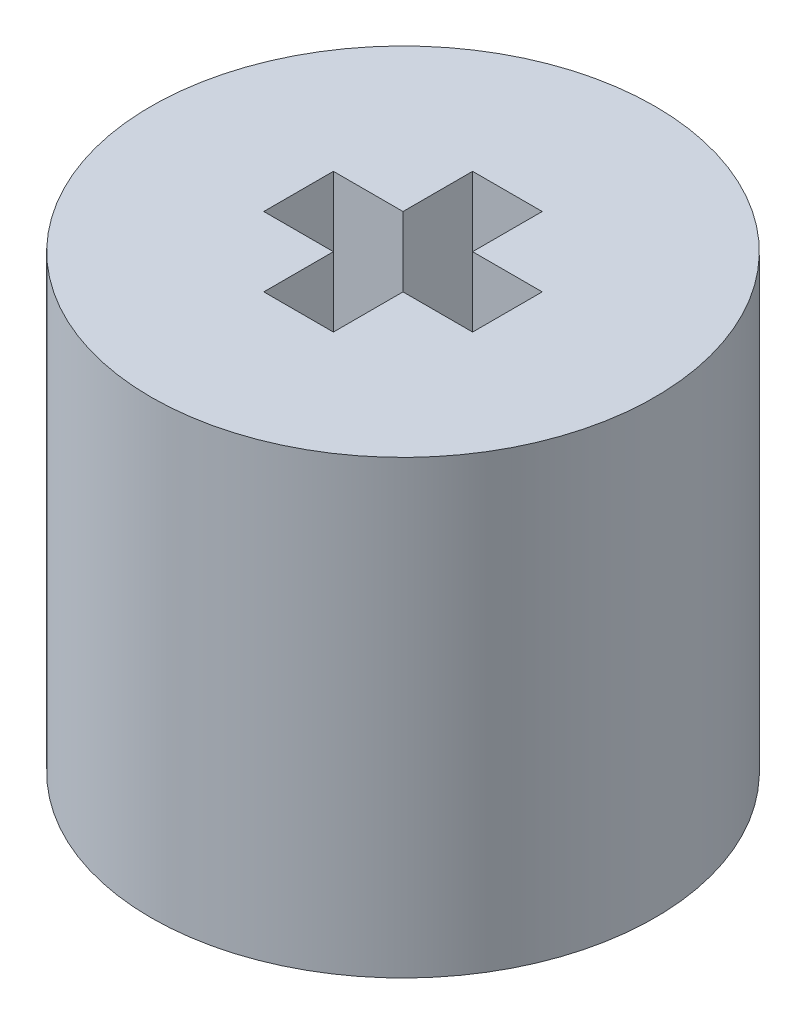
ISO-10303-21;
HEADER;
FILE_DESCRIPTION(('STEP AP214'),'2;1');
FILE_NAME('part.step','',(''),(''),'','','');
FILE_SCHEMA(('AUTOMOTIVE_DESIGN { 1 0 10303 214 1 1 1 1 }'));
ENDSEC;
DATA;
#1=APPLICATION_CONTEXT('core data for automotive mechanical design processes');
#2=APPLICATION_PROTOCOL_DEFINITION('international standard','automotive_design',2000,#1);
#3=PRODUCT_CONTEXT('',#1,'mechanical');
#4=PRODUCT('Part','Part','',(#3));
#5=PRODUCT_RELATED_PRODUCT_CATEGORY('part','',(#4));
#6=PRODUCT_DEFINITION_FORMATION('','',#4);
#7=PRODUCT_DEFINITION_CONTEXT('part definition',#1,'design');
#8=PRODUCT_DEFINITION('design','',#6,#7);
#9=PRODUCT_DEFINITION_SHAPE('','',#8);
#10=(LENGTH_UNIT() NAMED_UNIT(*) SI_UNIT(.MILLI.,.METRE.));
#11=(NAMED_UNIT(*) PLANE_ANGLE_UNIT() SI_UNIT($,.RADIAN.));
#12=(NAMED_UNIT(*) SI_UNIT($,.STERADIAN.) SOLID_ANGLE_UNIT());
#13=UNCERTAINTY_MEASURE_WITH_UNIT(LENGTH_MEASURE(1.E-05),#10,'distance_accuracy_value','');
#14=(GEOMETRIC_REPRESENTATION_CONTEXT(3) GLOBAL_UNCERTAINTY_ASSIGNED_CONTEXT((#13)) GLOBAL_UNIT_ASSIGNED_CONTEXT((#10,
#11,#12)) REPRESENTATION_CONTEXT('',''));
#15=CARTESIAN_POINT('',(0.,0.,0.));
#16=DIRECTION('',(0.,0.,1.));
#17=DIRECTION('',(1.,0.,0.));
#18=AXIS2_PLACEMENT_3D('',#15,#16,#17);
#19=CARTESIAN_POINT('',(0.,0.,0.));
#20=DIRECTION('',(0.,1.,0.));
#21=DIRECTION('',(0.,0.,1.));
#22=AXIS2_PLACEMENT_3D('',#19,#20,#21);
#23=PLANE('',#22);
#24=CARTESIAN_POINT('',(0.,0.,0.));
#25=DIRECTION('',(0.,1.,0.));
#26=DIRECTION('',(0.,0.,1.));
#27=AXIS2_PLACEMENT_3D('',#24,#25,#26);
#28=CIRCLE('',#27,7.239);
#29=CARTESIAN_POINT('',(0.,0.,7.239));
#30=VERTEX_POINT('',#29);
#31=EDGE_CURVE('E11',#30,#30,#28,.T.);
#32=ORIENTED_EDGE('',*,*,#31,.F.);
#33=EDGE_LOOP('',(#32));
#34=FACE_BOUND('',#33,.T.);
#35=DIRECTION('',(0.,0.,-1.));
#36=VECTOR('',#35,1.);
#37=CARTESIAN_POINT('',(1.5875,0.,-1.5875));
#38=LINE('',#37,#36);
#39=CARTESIAN_POINT('',(1.5875,0.,1.5875));
#40=VERTEX_POINT('',#39);
#41=CARTESIAN_POINT('',(1.5875,0.,-1.5875));
#42=VERTEX_POINT('',#41);
#43=EDGE_CURVE('E242',#40,#42,#38,.T.);
#44=ORIENTED_EDGE('',*,*,#43,.T.);
#45=DIRECTION('',(-1.,0.,0.));
#46=VECTOR('',#45,1.);
#47=CARTESIAN_POINT('',(-1.5875,0.,-1.5875));
#48=LINE('',#47,#46);
#49=CARTESIAN_POINT('',(-1.5875,0.,-1.5875));
#50=VERTEX_POINT('',#49);
#51=EDGE_CURVE('E259',#42,#50,#48,.T.);
#52=ORIENTED_EDGE('',*,*,#51,.T.);
#53=DIRECTION('',(0.,0.,1.));
#54=VECTOR('',#53,1.);
#55=CARTESIAN_POINT('',(-1.5875,0.,-1.5875));
#56=LINE('',#55,#54);
#57=CARTESIAN_POINT('',(-1.5875,0.,1.5875));
#58=VERTEX_POINT('',#57);
#59=EDGE_CURVE('E262',#50,#58,#56,.T.);
#60=ORIENTED_EDGE('',*,*,#59,.T.);
#61=DIRECTION('',(1.,0.,0.));
#62=VECTOR('',#61,1.);
#63=CARTESIAN_POINT('',(-1.5875,0.,1.5875));
#64=LINE('',#63,#62);
#65=EDGE_CURVE('E247',#58,#40,#64,.T.);
#66=ORIENTED_EDGE('',*,*,#65,.T.);
#67=EDGE_LOOP('',(#44,#52,#60,#66));
#68=FACE_BOUND('',#67,.T.);
#69=ADVANCED_FACE('F34',(#34,#68),#23,.F.);
#70=CARTESIAN_POINT('',(0.,6.35,0.));
#71=DIRECTION('',(0.,-1.,0.));
#72=DIRECTION('',(0.,0.,-1.));
#73=AXIS2_PLACEMENT_3D('',#70,#71,#72);
#74=CYLINDRICAL_SURFACE('',#73,7.239);
#75=ORIENTED_EDGE('',*,*,#31,.T.);
#76=EDGE_LOOP('',(#75));
#77=FACE_BOUND('',#76,.T.);
#78=CARTESIAN_POINT('',(0.,12.954,0.));
#79=DIRECTION('',(0.,1.,0.));
#80=DIRECTION('',(0.,0.,1.));
#81=AXIS2_PLACEMENT_3D('',#78,#79,#80);
#82=CIRCLE('',#81,7.239);
#83=CARTESIAN_POINT('',(0.,12.954,7.239));
#84=VERTEX_POINT('',#83);
#85=EDGE_CURVE('E161',#84,#84,#82,.T.);
#86=ORIENTED_EDGE('',*,*,#85,.F.);
#87=EDGE_LOOP('',(#86));
#88=FACE_BOUND('',#87,.T.);
#89=ADVANCED_FACE('F36',(#77,#88),#74,.T.);
#90=CARTESIAN_POINT('',(1.5875,6.35,-1.5875));
#91=DIRECTION('',(-1.,0.,0.));
#92=DIRECTION('',(0.,0.,1.));
#93=AXIS2_PLACEMENT_3D('',#90,#91,#92);
#94=PLANE('',#93);
#95=ORIENTED_EDGE('',*,*,#43,.F.);
#96=DIRECTION('',(0.,-1.,0.));
#97=VECTOR('',#96,1.);
#98=CARTESIAN_POINT('',(1.5875,6.35,1.5875));
#99=LINE('',#98,#97);
#100=CARTESIAN_POINT('',(1.5875,6.35,1.5875));
#101=VERTEX_POINT('',#100);
#102=EDGE_CURVE('E256',#101,#40,#99,.T.);
#103=ORIENTED_EDGE('',*,*,#102,.F.);
#104=DIRECTION('',(0.,0.,-1.));
#105=VECTOR('',#104,1.);
#106=CARTESIAN_POINT('',(1.5875,6.35,-1.5875));
#107=LINE('',#106,#105);
#108=CARTESIAN_POINT('',(1.5875,6.35,-1.5875));
#109=VERTEX_POINT('',#108);
#110=EDGE_CURVE('E243',#101,#109,#107,.T.);
#111=ORIENTED_EDGE('',*,*,#110,.T.);
#112=DIRECTION('',(0.,-1.,0.));
#113=VECTOR('',#112,1.);
#114=CARTESIAN_POINT('',(1.5875,6.35,-1.5875));
#115=LINE('',#114,#113);
#116=EDGE_CURVE('E42',#109,#42,#115,.T.);
#117=ORIENTED_EDGE('',*,*,#116,.T.);
#118=EDGE_LOOP('',(#95,#103,#111,#117));
#119=FACE_BOUND('',#118,.T.);
#120=ADVANCED_FACE('F275',(#119),#94,.T.);
#121=CARTESIAN_POINT('',(-1.5875,6.35,-1.5875));
#122=DIRECTION('',(0.,0.,1.));
#123=DIRECTION('',(1.,0.,0.));
#124=AXIS2_PLACEMENT_3D('',#121,#122,#123);
#125=PLANE('',#124);
#126=ORIENTED_EDGE('',*,*,#51,.F.);
#127=ORIENTED_EDGE('',*,*,#116,.F.);
#128=DIRECTION('',(-1.,0.,0.));
#129=VECTOR('',#128,1.);
#130=CARTESIAN_POINT('',(-1.5875,6.35,-1.5875));
#131=LINE('',#130,#129);
#132=CARTESIAN_POINT('',(-1.5875,6.35,-1.5875));
#133=VERTEX_POINT('',#132);
#134=EDGE_CURVE('E246',#109,#133,#131,.T.);
#135=ORIENTED_EDGE('',*,*,#134,.T.);
#136=DIRECTION('',(0.,-1.,0.));
#137=VECTOR('',#136,1.);
#138=CARTESIAN_POINT('',(-1.5875,6.35,-1.5875));
#139=LINE('',#138,#137);
#140=EDGE_CURVE('E271',#133,#50,#139,.T.);
#141=ORIENTED_EDGE('',*,*,#140,.T.);
#142=EDGE_LOOP('',(#126,#127,#135,#141));
#143=FACE_BOUND('',#142,.T.);
#144=ADVANCED_FACE('F287',(#143),#125,.T.);
#145=CARTESIAN_POINT('',(-1.5875,6.35,-1.5875));
#146=DIRECTION('',(1.,0.,0.));
#147=DIRECTION('',(0.,0.,-1.));
#148=AXIS2_PLACEMENT_3D('',#145,#146,#147);
#149=PLANE('',#148);
#150=ORIENTED_EDGE('',*,*,#59,.F.);
#151=ORIENTED_EDGE('',*,*,#140,.F.);
#152=DIRECTION('',(0.,0.,1.));
#153=VECTOR('',#152,1.);
#154=CARTESIAN_POINT('',(-1.5875,6.35,-1.5875));
#155=LINE('',#154,#153);
#156=CARTESIAN_POINT('',(-1.5875,6.35,1.5875));
#157=VERTEX_POINT('',#156);
#158=EDGE_CURVE('E250',#133,#157,#155,.T.);
#159=ORIENTED_EDGE('',*,*,#158,.T.);
#160=DIRECTION('',(0.,-1.,0.));
#161=VECTOR('',#160,1.);
#162=CARTESIAN_POINT('',(-1.5875,6.35,1.5875));
#163=LINE('',#162,#161);
#164=EDGE_CURVE('E269',#157,#58,#163,.T.);
#165=ORIENTED_EDGE('',*,*,#164,.T.);
#166=EDGE_LOOP('',(#150,#151,#159,#165));
#167=FACE_BOUND('',#166,.T.);
#168=ADVANCED_FACE('F289',(#167),#149,.T.);
#169=CARTESIAN_POINT('',(-1.5875,6.35,1.5875));
#170=DIRECTION('',(0.,0.,-1.));
#171=DIRECTION('',(-1.,0.,0.));
#172=AXIS2_PLACEMENT_3D('',#169,#170,#171);
#173=PLANE('',#172);
#174=ORIENTED_EDGE('',*,*,#65,.F.);
#175=ORIENTED_EDGE('',*,*,#164,.F.);
#176=DIRECTION('',(1.,0.,0.));
#177=VECTOR('',#176,1.);
#178=CARTESIAN_POINT('',(-1.5875,6.35,1.5875));
#179=LINE('',#178,#177);
#180=EDGE_CURVE('E253',#157,#101,#179,.T.);
#181=ORIENTED_EDGE('',*,*,#180,.T.);
#182=ORIENTED_EDGE('',*,*,#102,.T.);
#183=EDGE_LOOP('',(#174,#175,#181,#182));
#184=FACE_BOUND('',#183,.T.);
#185=ADVANCED_FACE('F283',(#184),#173,.T.);
#186=CARTESIAN_POINT('',(-16.0672213562373,6.35,0.));
#187=DIRECTION('',(0.,1.,0.));
#188=DIRECTION('',(0.,0.,1.));
#189=AXIS2_PLACEMENT_3D('',#186,#187,#188);
#190=PLANE('',#189);
#191=ORIENTED_EDGE('',*,*,#110,.F.);
#192=ORIENTED_EDGE('',*,*,#180,.F.);
#193=ORIENTED_EDGE('',*,*,#158,.F.);
#194=ORIENTED_EDGE('',*,*,#134,.F.);
#195=EDGE_LOOP('',(#191,#192,#193,#194));
#196=FACE_BOUND('',#195,.T.);
#197=ADVANCED_FACE('F285',(#196),#190,.F.);
#198=CARTESIAN_POINT('',(0.,12.954,0.));
#199=DIRECTION('',(0.,1.,0.));
#200=DIRECTION('',(0.,0.,1.));
#201=AXIS2_PLACEMENT_3D('',#198,#199,#200);
#202=PLANE('',#201);
#203=ORIENTED_EDGE('',*,*,#85,.T.);
#204=EDGE_LOOP('',(#203));
#205=FACE_BOUND('',#204,.T.);
#206=DIRECTION('',(1.,0.,0.));
#207=VECTOR('',#206,1.);
#208=CARTESIAN_POINT('',(3.,12.954,1.));
#209=LINE('',#208,#207);
#210=CARTESIAN_POINT('',(1.,12.954,1.));
#211=VERTEX_POINT('',#210);
#212=CARTESIAN_POINT('',(3.,12.954,1.));
#213=VERTEX_POINT('',#212);
#214=EDGE_CURVE('E155',#211,#213,#209,.T.);
#215=ORIENTED_EDGE('',*,*,#214,.F.);
#216=DIRECTION('',(0.,0.,-1.));
#217=VECTOR('',#216,1.);
#218=CARTESIAN_POINT('',(1.,12.954,1.));
#219=LINE('',#218,#217);
#220=CARTESIAN_POINT('',(1.,12.954,3.));
#221=VERTEX_POINT('',#220);
#222=EDGE_CURVE('E146',#221,#211,#219,.T.);
#223=ORIENTED_EDGE('',*,*,#222,.F.);
#224=DIRECTION('',(1.,0.,0.));
#225=VECTOR('',#224,1.);
#226=CARTESIAN_POINT('',(-1.,12.954,3.));
#227=LINE('',#226,#225);
#228=CARTESIAN_POINT('',(-1.,12.954,3.));
#229=VERTEX_POINT('',#228);
#230=EDGE_CURVE('E188',#229,#221,#227,.T.);
#231=ORIENTED_EDGE('',*,*,#230,.F.);
#232=DIRECTION('',(0.,0.,1.));
#233=VECTOR('',#232,1.);
#234=CARTESIAN_POINT('',(-1.,12.954,1.));
#235=LINE('',#234,#233);
#236=CARTESIAN_POINT('',(-1.,12.954,1.));
#237=VERTEX_POINT('',#236);
#238=EDGE_CURVE('E185',#237,#229,#235,.T.);
#239=ORIENTED_EDGE('',*,*,#238,.F.);
#240=DIRECTION('',(1.,0.,0.));
#241=VECTOR('',#240,1.);
#242=CARTESIAN_POINT('',(-1.,12.954,1.));
#243=LINE('',#242,#241);
#244=CARTESIAN_POINT('',(-3.,12.954,1.));
#245=VERTEX_POINT('',#244);
#246=EDGE_CURVE('E183',#245,#237,#243,.T.);
#247=ORIENTED_EDGE('',*,*,#246,.F.);
#248=DIRECTION('',(0.,0.,1.));
#249=VECTOR('',#248,1.);
#250=CARTESIAN_POINT('',(-3.,12.954,1.));
#251=LINE('',#250,#249);
#252=CARTESIAN_POINT('',(-3.,12.954,-1.));
#253=VERTEX_POINT('',#252);
#254=EDGE_CURVE('E181',#253,#245,#251,.T.);
#255=ORIENTED_EDGE('',*,*,#254,.F.);
#256=DIRECTION('',(-1.,0.,0.));
#257=VECTOR('',#256,1.);
#258=CARTESIAN_POINT('',(-1.,12.954,-1.));
#259=LINE('',#258,#257);
#260=CARTESIAN_POINT('',(-1.,12.954,-1.));
#261=VERTEX_POINT('',#260);
#262=EDGE_CURVE('E179',#261,#253,#259,.T.);
#263=ORIENTED_EDGE('',*,*,#262,.F.);
#264=DIRECTION('',(0.,0.,1.));
#265=VECTOR('',#264,1.);
#266=CARTESIAN_POINT('',(-1.,12.954,-3.));
#267=LINE('',#266,#265);
#268=CARTESIAN_POINT('',(-1.,12.954,-3.));
#269=VERTEX_POINT('',#268);
#270=EDGE_CURVE('E177',#269,#261,#267,.T.);
#271=ORIENTED_EDGE('',*,*,#270,.F.);
#272=DIRECTION('',(-1.,0.,0.));
#273=VECTOR('',#272,1.);
#274=CARTESIAN_POINT('',(-1.,12.954,-3.));
#275=LINE('',#274,#273);
#276=CARTESIAN_POINT('',(1.,12.954,-3.));
#277=VERTEX_POINT('',#276);
#278=EDGE_CURVE('E175',#277,#269,#275,.T.);
#279=ORIENTED_EDGE('',*,*,#278,.F.);
#280=DIRECTION('',(0.,0.,-1.));
#281=VECTOR('',#280,1.);
#282=CARTESIAN_POINT('',(1.,12.954,-3.));
#283=LINE('',#282,#281);
#284=CARTESIAN_POINT('',(1.,12.954,-1.));
#285=VERTEX_POINT('',#284);
#286=EDGE_CURVE('E173',#285,#277,#283,.T.);
#287=ORIENTED_EDGE('',*,*,#286,.F.);
#288=DIRECTION('',(-1.,0.,0.));
#289=VECTOR('',#288,1.);
#290=CARTESIAN_POINT('',(3.,12.954,-1.));
#291=LINE('',#290,#289);
#292=CARTESIAN_POINT('',(3.,12.954,-1.));
#293=VERTEX_POINT('',#292);
#294=EDGE_CURVE('E169',#293,#285,#291,.T.);
#295=ORIENTED_EDGE('',*,*,#294,.F.);
#296=DIRECTION('',(0.,0.,-1.));
#297=VECTOR('',#296,1.);
#298=CARTESIAN_POINT('',(3.,12.954,1.));
#299=LINE('',#298,#297);
#300=EDGE_CURVE('E167',#213,#293,#299,.T.);
#301=ORIENTED_EDGE('',*,*,#300,.F.);
#302=EDGE_LOOP('',(#215,#223,#231,#239,#247,#255,#263,#271,#279,#287,#295,#301));
#303=FACE_BOUND('',#302,.T.);
#304=ADVANCED_FACE('F165',(#205,#303),#202,.T.);
#305=CARTESIAN_POINT('',(1.,12.954,1.));
#306=DIRECTION('',(-1.,0.,0.));
#307=DIRECTION('',(0.,0.,1.));
#308=AXIS2_PLACEMENT_3D('',#305,#306,#307);
#309=PLANE('',#308);
#310=DIRECTION('',(0.,0.,-1.));
#311=VECTOR('',#310,1.);
#312=CARTESIAN_POINT('',(1.,6.604,1.));
#313=LINE('',#312,#311);
#314=CARTESIAN_POINT('',(0.999999999999997,6.604,3.));
#315=VERTEX_POINT('',#314);
#316=CARTESIAN_POINT('',(1.,6.604,1.));
#317=VERTEX_POINT('',#316);
#318=EDGE_CURVE('E49',#315,#317,#313,.T.);
#319=ORIENTED_EDGE('',*,*,#318,.F.);
#320=DIRECTION('',(0.,-1.,0.));
#321=VECTOR('',#320,1.);
#322=CARTESIAN_POINT('',(1.,12.954,3.));
#323=LINE('',#322,#321);
#324=EDGE_CURVE('E151',#221,#315,#323,.T.);
#325=ORIENTED_EDGE('',*,*,#324,.F.);
#326=ORIENTED_EDGE('',*,*,#222,.T.);
#327=DIRECTION('',(0.,-1.,0.));
#328=VECTOR('',#327,1.);
#329=CARTESIAN_POINT('',(1.,12.954,1.));
#330=LINE('',#329,#328);
#331=EDGE_CURVE('E149',#211,#317,#330,.T.);
#332=ORIENTED_EDGE('',*,*,#331,.T.);
#333=EDGE_LOOP('',(#319,#325,#326,#332));
#334=FACE_BOUND('',#333,.T.);
#335=ADVANCED_FACE('F148',(#334),#309,.T.);
#336=CARTESIAN_POINT('',(3.,12.954,1.));
#337=DIRECTION('',(0.,0.,-1.));
#338=DIRECTION('',(-1.,0.,0.));
#339=AXIS2_PLACEMENT_3D('',#336,#337,#338);
#340=PLANE('',#339);
#341=DIRECTION('',(1.,0.,0.));
#342=VECTOR('',#341,1.);
#343=CARTESIAN_POINT('',(3.,6.604,1.));
#344=LINE('',#343,#342);
#345=CARTESIAN_POINT('',(3.,6.604,1.));
#346=VERTEX_POINT('',#345);
#347=EDGE_CURVE('E53',#317,#346,#344,.T.);
#348=ORIENTED_EDGE('',*,*,#347,.F.);
#349=ORIENTED_EDGE('',*,*,#331,.F.);
#350=ORIENTED_EDGE('',*,*,#214,.T.);
#351=DIRECTION('',(0.,-1.,0.));
#352=VECTOR('',#351,1.);
#353=CARTESIAN_POINT('',(3.,12.954,1.));
#354=LINE('',#353,#352);
#355=EDGE_CURVE('E162',#213,#346,#354,.T.);
#356=ORIENTED_EDGE('',*,*,#355,.T.);
#357=EDGE_LOOP('',(#348,#349,#350,#356));
#358=FACE_BOUND('',#357,.T.);
#359=ADVANCED_FACE('F159',(#358),#340,.T.);
#360=CARTESIAN_POINT('',(3.,12.954,1.));
#361=DIRECTION('',(-1.,0.,0.));
#362=DIRECTION('',(0.,0.,1.));
#363=AXIS2_PLACEMENT_3D('',#360,#361,#362);
#364=PLANE('',#363);
#365=DIRECTION('',(0.,0.,-1.));
#366=VECTOR('',#365,1.);
#367=CARTESIAN_POINT('',(3.,6.604,1.));
#368=LINE('',#367,#366);
#369=CARTESIAN_POINT('',(3.,6.604,-1.));
#370=VERTEX_POINT('',#369);
#371=EDGE_CURVE('E192',#346,#370,#368,.T.);
#372=ORIENTED_EDGE('',*,*,#371,.F.);
#373=ORIENTED_EDGE('',*,*,#355,.F.);
#374=ORIENTED_EDGE('',*,*,#300,.T.);
#375=DIRECTION('',(0.,-1.,0.));
#376=VECTOR('',#375,1.);
#377=CARTESIAN_POINT('',(3.,12.954,-1.));
#378=LINE('',#377,#376);
#379=EDGE_CURVE('E236',#293,#370,#378,.T.);
#380=ORIENTED_EDGE('',*,*,#379,.T.);
#381=EDGE_LOOP('',(#372,#373,#374,#380));
#382=FACE_BOUND('',#381,.T.);
#383=ADVANCED_FACE('F366',(#382),#364,.T.);
#384=CARTESIAN_POINT('',(3.,12.954,-1.));
#385=DIRECTION('',(0.,0.,1.));
#386=DIRECTION('',(1.,0.,0.));
#387=AXIS2_PLACEMENT_3D('',#384,#385,#386);
#388=PLANE('',#387);
#389=DIRECTION('',(-1.,0.,0.));
#390=VECTOR('',#389,1.);
#391=CARTESIAN_POINT('',(3.,6.604,-1.));
#392=LINE('',#391,#390);
#393=CARTESIAN_POINT('',(1.,6.604,-1.));
#394=VERTEX_POINT('',#393);
#395=EDGE_CURVE('E194',#370,#394,#392,.T.);
#396=ORIENTED_EDGE('',*,*,#395,.F.);
#397=ORIENTED_EDGE('',*,*,#379,.F.);
#398=ORIENTED_EDGE('',*,*,#294,.T.);
#399=DIRECTION('',(0.,-1.,0.));
#400=VECTOR('',#399,1.);
#401=CARTESIAN_POINT('',(1.,12.954,-1.));
#402=LINE('',#401,#400);
#403=EDGE_CURVE('E233',#285,#394,#402,.T.);
#404=ORIENTED_EDGE('',*,*,#403,.T.);
#405=EDGE_LOOP('',(#396,#397,#398,#404));
#406=FACE_BOUND('',#405,.T.);
#407=ADVANCED_FACE('F375',(#406),#388,.T.);
#408=CARTESIAN_POINT('',(1.,12.954,-3.));
#409=DIRECTION('',(-1.,0.,0.));
#410=DIRECTION('',(0.,0.,1.));
#411=AXIS2_PLACEMENT_3D('',#408,#409,#410);
#412=PLANE('',#411);
#413=DIRECTION('',(0.,0.,-1.));
#414=VECTOR('',#413,1.);
#415=CARTESIAN_POINT('',(1.,6.604,-3.));
#416=LINE('',#415,#414);
#417=CARTESIAN_POINT('',(0.999999999999997,6.604,-3.));
#418=VERTEX_POINT('',#417);
#419=EDGE_CURVE('E196',#394,#418,#416,.T.);
#420=ORIENTED_EDGE('',*,*,#419,.F.);
#421=ORIENTED_EDGE('',*,*,#403,.F.);
#422=ORIENTED_EDGE('',*,*,#286,.T.);
#423=DIRECTION('',(0.,-1.,0.));
#424=VECTOR('',#423,1.);
#425=CARTESIAN_POINT('',(1.,12.954,-3.));
#426=LINE('',#425,#424);
#427=EDGE_CURVE('E230',#277,#418,#426,.T.);
#428=ORIENTED_EDGE('',*,*,#427,.T.);
#429=EDGE_LOOP('',(#420,#421,#422,#428));
#430=FACE_BOUND('',#429,.T.);
#431=ADVANCED_FACE('F385',(#430),#412,.T.);
#432=CARTESIAN_POINT('',(-1.,12.954,-3.));
#433=DIRECTION('',(0.,0.,1.));
#434=DIRECTION('',(1.,0.,0.));
#435=AXIS2_PLACEMENT_3D('',#432,#433,#434);
#436=PLANE('',#435);
#437=DIRECTION('',(-1.,0.,0.));
#438=VECTOR('',#437,1.);
#439=CARTESIAN_POINT('',(-1.,6.604,-3.));
#440=LINE('',#439,#438);
#441=CARTESIAN_POINT('',(-1.,6.604,-3.));
#442=VERTEX_POINT('',#441);
#443=EDGE_CURVE('E198',#418,#442,#440,.T.);
#444=ORIENTED_EDGE('',*,*,#443,.F.);
#445=ORIENTED_EDGE('',*,*,#427,.F.);
#446=ORIENTED_EDGE('',*,*,#278,.T.);
#447=DIRECTION('',(0.,-1.,0.));
#448=VECTOR('',#447,1.);
#449=CARTESIAN_POINT('',(-1.,12.954,-3.));
#450=LINE('',#449,#448);
#451=EDGE_CURVE('E227',#269,#442,#450,.T.);
#452=ORIENTED_EDGE('',*,*,#451,.T.);
#453=EDGE_LOOP('',(#444,#445,#446,#452));
#454=FACE_BOUND('',#453,.T.);
#455=ADVANCED_FACE('F395',(#454),#436,.T.);
#456=CARTESIAN_POINT('',(-1.,12.954,-3.));
#457=DIRECTION('',(1.,0.,0.));
#458=DIRECTION('',(0.,0.,-1.));
#459=AXIS2_PLACEMENT_3D('',#456,#457,#458);
#460=PLANE('',#459);
#461=DIRECTION('',(0.,0.,1.));
#462=VECTOR('',#461,1.);
#463=CARTESIAN_POINT('',(-1.,6.604,-3.));
#464=LINE('',#463,#462);
#465=CARTESIAN_POINT('',(-1.,6.604,-1.));
#466=VERTEX_POINT('',#465);
#467=EDGE_CURVE('E200',#442,#466,#464,.T.);
#468=ORIENTED_EDGE('',*,*,#467,.F.);
#469=ORIENTED_EDGE('',*,*,#451,.F.);
#470=ORIENTED_EDGE('',*,*,#270,.T.);
#471=DIRECTION('',(0.,-1.,0.));
#472=VECTOR('',#471,1.);
#473=CARTESIAN_POINT('',(-1.,12.954,-1.));
#474=LINE('',#473,#472);
#475=EDGE_CURVE('E224',#261,#466,#474,.T.);
#476=ORIENTED_EDGE('',*,*,#475,.T.);
#477=EDGE_LOOP('',(#468,#469,#470,#476));
#478=FACE_BOUND('',#477,.T.);
#479=ADVANCED_FACE('F405',(#478),#460,.T.);
#480=CARTESIAN_POINT('',(-1.,12.954,-1.));
#481=DIRECTION('',(0.,0.,1.));
#482=DIRECTION('',(1.,0.,0.));
#483=AXIS2_PLACEMENT_3D('',#480,#481,#482);
#484=PLANE('',#483);
#485=DIRECTION('',(-1.,0.,0.));
#486=VECTOR('',#485,1.);
#487=CARTESIAN_POINT('',(-1.,6.604,-1.));
#488=LINE('',#487,#486);
#489=CARTESIAN_POINT('',(-3.,6.604,-1.));
#490=VERTEX_POINT('',#489);
#491=EDGE_CURVE('E202',#466,#490,#488,.T.);
#492=ORIENTED_EDGE('',*,*,#491,.F.);
#493=ORIENTED_EDGE('',*,*,#475,.F.);
#494=ORIENTED_EDGE('',*,*,#262,.T.);
#495=DIRECTION('',(0.,-1.,0.));
#496=VECTOR('',#495,1.);
#497=CARTESIAN_POINT('',(-3.,12.954,-1.));
#498=LINE('',#497,#496);
#499=EDGE_CURVE('E221',#253,#490,#498,.T.);
#500=ORIENTED_EDGE('',*,*,#499,.T.);
#501=EDGE_LOOP('',(#492,#493,#494,#500));
#502=FACE_BOUND('',#501,.T.);
#503=ADVANCED_FACE('F415',(#502),#484,.T.);
#504=CARTESIAN_POINT('',(-3.,12.954,1.));
#505=DIRECTION('',(1.,0.,0.));
#506=DIRECTION('',(0.,0.,-1.));
#507=AXIS2_PLACEMENT_3D('',#504,#505,#506);
#508=PLANE('',#507);
#509=DIRECTION('',(0.,0.,1.));
#510=VECTOR('',#509,1.);
#511=CARTESIAN_POINT('',(-3.,6.604,1.));
#512=LINE('',#511,#510);
#513=CARTESIAN_POINT('',(-3.,6.604,1.));
#514=VERTEX_POINT('',#513);
#515=EDGE_CURVE('E204',#490,#514,#512,.T.);
#516=ORIENTED_EDGE('',*,*,#515,.F.);
#517=ORIENTED_EDGE('',*,*,#499,.F.);
#518=ORIENTED_EDGE('',*,*,#254,.T.);
#519=DIRECTION('',(0.,-1.,0.));
#520=VECTOR('',#519,1.);
#521=CARTESIAN_POINT('',(-3.,12.954,1.));
#522=LINE('',#521,#520);
#523=EDGE_CURVE('E218',#245,#514,#522,.T.);
#524=ORIENTED_EDGE('',*,*,#523,.T.);
#525=EDGE_LOOP('',(#516,#517,#518,#524));
#526=FACE_BOUND('',#525,.T.);
#527=ADVANCED_FACE('F425',(#526),#508,.T.);
#528=CARTESIAN_POINT('',(-1.,12.954,1.));
#529=DIRECTION('',(0.,0.,-1.));
#530=DIRECTION('',(-1.,0.,0.));
#531=AXIS2_PLACEMENT_3D('',#528,#529,#530);
#532=PLANE('',#531);
#533=DIRECTION('',(1.,0.,0.));
#534=VECTOR('',#533,1.);
#535=CARTESIAN_POINT('',(-1.,6.604,1.));
#536=LINE('',#535,#534);
#537=CARTESIAN_POINT('',(-0.999999999999999,6.604,1.));
#538=VERTEX_POINT('',#537);
#539=EDGE_CURVE('E206',#514,#538,#536,.T.);
#540=ORIENTED_EDGE('',*,*,#539,.F.);
#541=ORIENTED_EDGE('',*,*,#523,.F.);
#542=ORIENTED_EDGE('',*,*,#246,.T.);
#543=DIRECTION('',(0.,-1.,0.));
#544=VECTOR('',#543,1.);
#545=CARTESIAN_POINT('',(-1.,12.954,1.));
#546=LINE('',#545,#544);
#547=EDGE_CURVE('E215',#237,#538,#546,.T.);
#548=ORIENTED_EDGE('',*,*,#547,.T.);
#549=EDGE_LOOP('',(#540,#541,#542,#548));
#550=FACE_BOUND('',#549,.T.);
#551=ADVANCED_FACE('F435',(#550),#532,.T.);
#552=CARTESIAN_POINT('',(-1.,12.954,1.));
#553=DIRECTION('',(1.,0.,0.));
#554=DIRECTION('',(0.,0.,-1.));
#555=AXIS2_PLACEMENT_3D('',#552,#553,#554);
#556=PLANE('',#555);
#557=DIRECTION('',(0.,0.,1.));
#558=VECTOR('',#557,1.);
#559=CARTESIAN_POINT('',(-1.,6.604,1.));
#560=LINE('',#559,#558);
#561=CARTESIAN_POINT('',(-1.,6.604,3.));
#562=VERTEX_POINT('',#561);
#563=EDGE_CURVE('E208',#538,#562,#560,.T.);
#564=ORIENTED_EDGE('',*,*,#563,.F.);
#565=ORIENTED_EDGE('',*,*,#547,.F.);
#566=ORIENTED_EDGE('',*,*,#238,.T.);
#567=DIRECTION('',(0.,-1.,0.));
#568=VECTOR('',#567,1.);
#569=CARTESIAN_POINT('',(-1.,12.954,3.));
#570=LINE('',#569,#568);
#571=EDGE_CURVE('E212',#229,#562,#570,.T.);
#572=ORIENTED_EDGE('',*,*,#571,.T.);
#573=EDGE_LOOP('',(#564,#565,#566,#572));
#574=FACE_BOUND('',#573,.T.);
#575=ADVANCED_FACE('F445',(#574),#556,.T.);
#576=CARTESIAN_POINT('',(-1.,12.954,3.));
#577=DIRECTION('',(0.,0.,-1.));
#578=DIRECTION('',(-1.,0.,0.));
#579=AXIS2_PLACEMENT_3D('',#576,#577,#578);
#580=PLANE('',#579);
#581=DIRECTION('',(1.,0.,0.));
#582=VECTOR('',#581,1.);
#583=CARTESIAN_POINT('',(-1.,6.604,3.));
#584=LINE('',#583,#582);
#585=EDGE_CURVE('E156',#562,#315,#584,.T.);
#586=ORIENTED_EDGE('',*,*,#585,.F.);
#587=ORIENTED_EDGE('',*,*,#571,.F.);
#588=ORIENTED_EDGE('',*,*,#230,.T.);
#589=ORIENTED_EDGE('',*,*,#324,.T.);
#590=EDGE_LOOP('',(#586,#587,#588,#589));
#591=FACE_BOUND('',#590,.T.);
#592=ADVANCED_FACE('F455',(#591),#580,.T.);
#593=CARTESIAN_POINT('',(-16.0672213562373,6.604,0.));
#594=DIRECTION('',(0.,1.,0.));
#595=DIRECTION('',(0.,0.,1.));
#596=AXIS2_PLACEMENT_3D('',#593,#594,#595);
#597=PLANE('',#596);
#598=ORIENTED_EDGE('',*,*,#318,.T.);
#599=ORIENTED_EDGE('',*,*,#347,.T.);
#600=ORIENTED_EDGE('',*,*,#371,.T.);
#601=ORIENTED_EDGE('',*,*,#395,.T.);
#602=ORIENTED_EDGE('',*,*,#419,.T.);
#603=ORIENTED_EDGE('',*,*,#443,.T.);
#604=ORIENTED_EDGE('',*,*,#467,.T.);
#605=ORIENTED_EDGE('',*,*,#491,.T.);
#606=ORIENTED_EDGE('',*,*,#515,.T.);
#607=ORIENTED_EDGE('',*,*,#539,.T.);
#608=ORIENTED_EDGE('',*,*,#563,.T.);
#609=ORIENTED_EDGE('',*,*,#585,.T.);
#610=EDGE_LOOP('',(#598,#599,#600,#601,#602,#603,#604,#605,#606,#607,#608,#609));
#611=FACE_BOUND('',#610,.T.);
#612=ADVANCED_FACE('F465',(#611),#597,.T.);
#613=CLOSED_SHELL('',(#69,#89,#120,#144,#168,#185,#197,#304,#335,#359,#383,#407,#431,#455,#479,
#503,#527,#551,#575,#592,#612));
#614=MANIFOLD_SOLID_BREP('B2',#613);
#615=ADVANCED_BREP_SHAPE_REPRESENTATION('',(#18,#614),#14);
#616=SHAPE_DEFINITION_REPRESENTATION(#9,#615);
ENDSEC;
END-ISO-10303-21;
